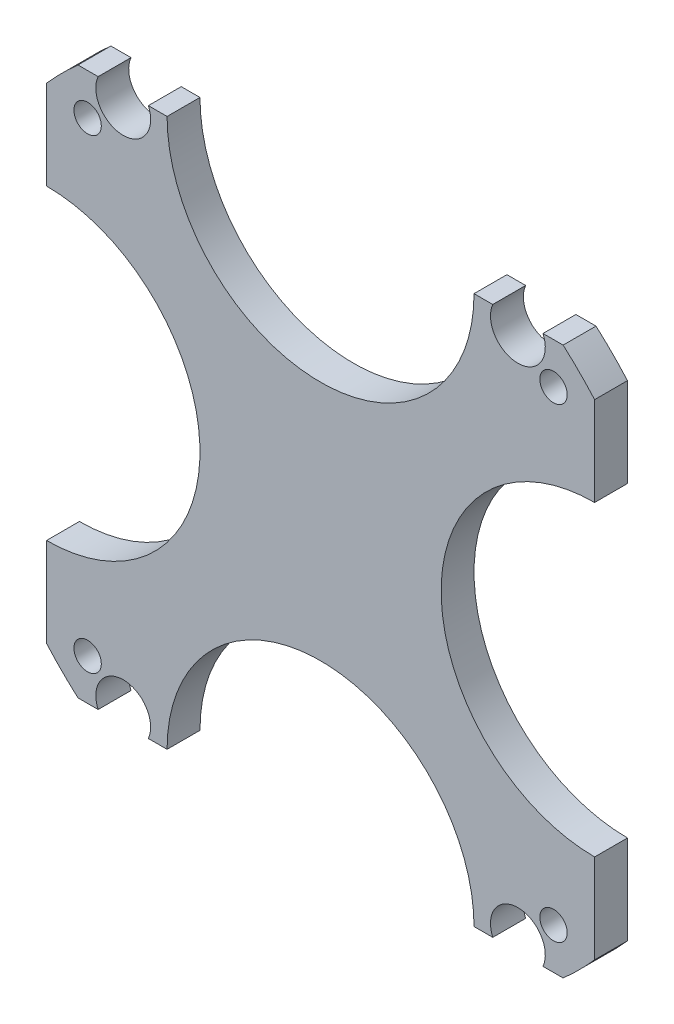
ISO-10303-21;
HEADER;
FILE_DESCRIPTION(('STEP AP214'),'2;1');
FILE_NAME('part.step','',(''),(''),'','','');
FILE_SCHEMA(('AUTOMOTIVE_DESIGN { 1 0 10303 214 1 1 1 1 }'));
ENDSEC;
DATA;
#1=APPLICATION_CONTEXT('core data for automotive mechanical design processes');
#2=APPLICATION_PROTOCOL_DEFINITION('international standard','automotive_design',2000,#1);
#3=PRODUCT_CONTEXT('',#1,'mechanical');
#4=PRODUCT('Part','Part','',(#3));
#5=PRODUCT_RELATED_PRODUCT_CATEGORY('part','',(#4));
#6=PRODUCT_DEFINITION_FORMATION('','',#4);
#7=PRODUCT_DEFINITION_CONTEXT('part definition',#1,'design');
#8=PRODUCT_DEFINITION('design','',#6,#7);
#9=PRODUCT_DEFINITION_SHAPE('','',#8);
#10=(LENGTH_UNIT() NAMED_UNIT(*) SI_UNIT(.MILLI.,.METRE.));
#11=(NAMED_UNIT(*) PLANE_ANGLE_UNIT() SI_UNIT($,.RADIAN.));
#12=(NAMED_UNIT(*) SI_UNIT($,.STERADIAN.) SOLID_ANGLE_UNIT());
#13=UNCERTAINTY_MEASURE_WITH_UNIT(LENGTH_MEASURE(1.E-05),#10,'distance_accuracy_value','');
#14=(GEOMETRIC_REPRESENTATION_CONTEXT(3) GLOBAL_UNCERTAINTY_ASSIGNED_CONTEXT((#13)) GLOBAL_UNIT_ASSIGNED_CONTEXT((#10,
#11,#12)) REPRESENTATION_CONTEXT('',''));
#15=CARTESIAN_POINT('',(0.,0.,0.));
#16=DIRECTION('',(0.,0.,1.));
#17=DIRECTION('',(1.,0.,0.));
#18=AXIS2_PLACEMENT_3D('',#15,#16,#17);
#19=CARTESIAN_POINT('',(0.,-25.,3.));
#20=DIRECTION('',(0.,1.,0.));
#21=DIRECTION('',(0.,0.,1.));
#22=AXIS2_PLACEMENT_3D('',#19,#20,#21);
#23=PLANE('',#22);
#24=DIRECTION('',(0.,0.,1.));
#25=VECTOR('',#24,1.);
#26=CARTESIAN_POINT('',(-20.2912878474779,-25.,-9.));
#27=LINE('',#26,#25);
#28=CARTESIAN_POINT('',(-20.2912878474779,-25.,3.));
#29=VERTEX_POINT('',#28);
#30=CARTESIAN_POINT('',(-20.2912878474779,-25.,0.));
#31=VERTEX_POINT('',#30);
#32=EDGE_CURVE('E266',#29,#31,#27,.F.);
#33=ORIENTED_EDGE('',*,*,#32,.F.);
#34=DIRECTION('',(1.,0.,0.));
#35=VECTOR('',#34,1.);
#36=CARTESIAN_POINT('',(0.,-25.,3.));
#37=LINE('',#36,#35);
#38=CARTESIAN_POINT('',(-22.1274659778656,-25.,3.));
#39=VERTEX_POINT('',#38);
#40=EDGE_CURVE('E231',#39,#29,#37,.T.);
#41=ORIENTED_EDGE('',*,*,#40,.F.);
#42=DIRECTION('',(0.,0.,-1.));
#43=VECTOR('',#42,1.);
#44=CARTESIAN_POINT('',(-22.1274659778656,-25.,3.));
#45=LINE('',#44,#43);
#46=CARTESIAN_POINT('',(-22.1274659778656,-25.,0.));
#47=VERTEX_POINT('',#46);
#48=EDGE_CURVE('E307',#39,#47,#45,.T.);
#49=ORIENTED_EDGE('',*,*,#48,.T.);
#50=DIRECTION('',(1.,0.,0.));
#51=VECTOR('',#50,1.);
#52=CARTESIAN_POINT('',(0.,-25.,0.));
#53=LINE('',#52,#51);
#54=EDGE_CURVE('E331',#47,#31,#53,.T.);
#55=ORIENTED_EDGE('',*,*,#54,.T.);
#56=EDGE_LOOP('',(#33,#41,#49,#55));
#57=FACE_BOUND('',#56,.T.);
#58=ADVANCED_FACE('F45',(#57),#23,.F.);
#59=DIRECTION('',(0.,0.,1.));
#60=VECTOR('',#59,1.);
#61=CARTESIAN_POINT('',(-15.7087121525221,-25.,-9.));
#62=LINE('',#61,#60);
#63=CARTESIAN_POINT('',(-15.7087121525221,-25.,0.));
#64=VERTEX_POINT('',#63);
#65=CARTESIAN_POINT('',(-15.7087121525221,-25.,3.));
#66=VERTEX_POINT('',#65);
#67=EDGE_CURVE('E268',#64,#66,#62,.T.);
#68=ORIENTED_EDGE('',*,*,#67,.F.);
#69=CARTESIAN_POINT('',(-14.,-25.,0.));
#70=VERTEX_POINT('',#69);
#71=EDGE_CURVE('E330',#64,#70,#53,.T.);
#72=ORIENTED_EDGE('',*,*,#71,.T.);
#73=DIRECTION('',(0.,0.,-1.));
#74=VECTOR('',#73,1.);
#75=CARTESIAN_POINT('',(-14.,-25.,3.));
#76=LINE('',#75,#74);
#77=CARTESIAN_POINT('',(-14.,-25.,3.));
#78=VERTEX_POINT('',#77);
#79=EDGE_CURVE('E395',#78,#70,#76,.T.);
#80=ORIENTED_EDGE('',*,*,#79,.F.);
#81=EDGE_CURVE('E232',#66,#78,#37,.T.);
#82=ORIENTED_EDGE('',*,*,#81,.F.);
#83=EDGE_LOOP('',(#68,#72,#80,#82));
#84=FACE_BOUND('',#83,.T.);
#85=ADVANCED_FACE('F455',(#84),#23,.F.);
#86=CARTESIAN_POINT('',(14.,-25.,0.));
#87=VERTEX_POINT('',#86);
#88=CARTESIAN_POINT('',(15.7087121525221,-25.,0.));
#89=VERTEX_POINT('',#88);
#90=EDGE_CURVE('E220',#87,#89,#53,.T.);
#91=ORIENTED_EDGE('',*,*,#90,.T.);
#92=DIRECTION('',(0.,0.,1.));
#93=VECTOR('',#92,1.);
#94=CARTESIAN_POINT('',(15.7087121525221,-25.,-9.));
#95=LINE('',#94,#93);
#96=CARTESIAN_POINT('',(15.7087121525221,-25.,3.));
#97=VERTEX_POINT('',#96);
#98=EDGE_CURVE('E60',#89,#97,#95,.T.);
#99=ORIENTED_EDGE('',*,*,#98,.T.);
#100=CARTESIAN_POINT('',(14.,-25.,3.));
#101=VERTEX_POINT('',#100);
#102=EDGE_CURVE('E218',#101,#97,#37,.T.);
#103=ORIENTED_EDGE('',*,*,#102,.F.);
#104=DIRECTION('',(0.,0.,-1.));
#105=VECTOR('',#104,1.);
#106=CARTESIAN_POINT('',(14.,-25.,3.));
#107=LINE('',#106,#105);
#108=EDGE_CURVE('E393',#101,#87,#107,.T.);
#109=ORIENTED_EDGE('',*,*,#108,.T.);
#110=EDGE_LOOP('',(#91,#99,#103,#109));
#111=FACE_BOUND('',#110,.T.);
#112=ADVANCED_FACE('F216',(#111),#23,.F.);
#113=CARTESIAN_POINT('',(0.,25.,3.));
#114=DIRECTION('',(0.,1.,0.));
#115=DIRECTION('',(0.,0.,1.));
#116=AXIS2_PLACEMENT_3D('',#113,#114,#115);
#117=PLANE('',#116);
#118=DIRECTION('',(1.,0.,0.));
#119=VECTOR('',#118,1.);
#120=CARTESIAN_POINT('',(0.,25.,3.));
#121=LINE('',#120,#119);
#122=CARTESIAN_POINT('',(14.,25.,3.));
#123=VERTEX_POINT('',#122);
#124=CARTESIAN_POINT('',(15.7087121525221,25.,3.));
#125=VERTEX_POINT('',#124);
#126=EDGE_CURVE('E279',#123,#125,#121,.T.);
#127=ORIENTED_EDGE('',*,*,#126,.T.);
#128=DIRECTION('',(0.,0.,1.));
#129=VECTOR('',#128,1.);
#130=CARTESIAN_POINT('',(15.7087121525221,25.,-9.));
#131=LINE('',#130,#129);
#132=CARTESIAN_POINT('',(15.7087121525221,25.,0.));
#133=VERTEX_POINT('',#132);
#134=EDGE_CURVE('E262',#125,#133,#131,.F.);
#135=ORIENTED_EDGE('',*,*,#134,.T.);
#136=DIRECTION('',(1.,0.,0.));
#137=VECTOR('',#136,1.);
#138=CARTESIAN_POINT('',(0.,25.,0.));
#139=LINE('',#138,#137);
#140=CARTESIAN_POINT('',(14.,25.,0.));
#141=VERTEX_POINT('',#140);
#142=EDGE_CURVE('E348',#141,#133,#139,.T.);
#143=ORIENTED_EDGE('',*,*,#142,.F.);
#144=DIRECTION('',(0.,0.,-1.));
#145=VECTOR('',#144,1.);
#146=CARTESIAN_POINT('',(14.,25.,3.));
#147=LINE('',#146,#145);
#148=EDGE_CURVE('E286',#123,#141,#147,.T.);
#149=ORIENTED_EDGE('',*,*,#148,.F.);
#150=EDGE_LOOP('',(#127,#135,#143,#149));
#151=FACE_BOUND('',#150,.T.);
#152=ADVANCED_FACE('F283',(#151),#117,.T.);
#153=CARTESIAN_POINT('',(20.2912878474779,25.,0.));
#154=VERTEX_POINT('',#153);
#155=CARTESIAN_POINT('',(22.1274659778656,25.,0.));
#156=VERTEX_POINT('',#155);
#157=EDGE_CURVE('E351',#154,#156,#139,.T.);
#158=ORIENTED_EDGE('',*,*,#157,.F.);
#159=DIRECTION('',(0.,0.,1.));
#160=VECTOR('',#159,1.);
#161=CARTESIAN_POINT('',(20.2912878474779,25.,-9.));
#162=LINE('',#161,#160);
#163=CARTESIAN_POINT('',(20.2912878474779,25.,3.));
#164=VERTEX_POINT('',#163);
#165=EDGE_CURVE('E68',#154,#164,#162,.T.);
#166=ORIENTED_EDGE('',*,*,#165,.T.);
#167=CARTESIAN_POINT('',(22.1274659778656,25.,3.));
#168=VERTEX_POINT('',#167);
#169=EDGE_CURVE('E281',#164,#168,#121,.T.);
#170=ORIENTED_EDGE('',*,*,#169,.T.);
#171=DIRECTION('',(0.,0.,-1.));
#172=VECTOR('',#171,1.);
#173=CARTESIAN_POINT('',(22.1274659778656,25.,3.));
#174=LINE('',#173,#172);
#175=EDGE_CURVE('E379',#168,#156,#174,.T.);
#176=ORIENTED_EDGE('',*,*,#175,.T.);
#177=EDGE_LOOP('',(#158,#166,#170,#176));
#178=FACE_BOUND('',#177,.T.);
#179=ADVANCED_FACE('F562',(#178),#117,.T.);
#180=DIRECTION('',(0.,0.,1.));
#181=VECTOR('',#180,1.);
#182=CARTESIAN_POINT('',(-20.2912878474779,25.,-9.));
#183=LINE('',#182,#181);
#184=CARTESIAN_POINT('',(-20.2912878474779,25.,0.));
#185=VERTEX_POINT('',#184);
#186=CARTESIAN_POINT('',(-20.2912878474779,25.,3.));
#187=VERTEX_POINT('',#186);
#188=EDGE_CURVE('E257',#185,#187,#183,.T.);
#189=ORIENTED_EDGE('',*,*,#188,.F.);
#190=CARTESIAN_POINT('',(-22.1274659778656,25.,0.));
#191=VERTEX_POINT('',#190);
#192=EDGE_CURVE('E352',#191,#185,#139,.T.);
#193=ORIENTED_EDGE('',*,*,#192,.F.);
#194=DIRECTION('',(0.,0.,-1.));
#195=VECTOR('',#194,1.);
#196=CARTESIAN_POINT('',(-22.1274659778656,25.,3.));
#197=LINE('',#196,#195);
#198=CARTESIAN_POINT('',(-22.1274659778656,25.,3.));
#199=VERTEX_POINT('',#198);
#200=EDGE_CURVE('E373',#199,#191,#197,.T.);
#201=ORIENTED_EDGE('',*,*,#200,.F.);
#202=EDGE_CURVE('E291',#199,#187,#121,.T.);
#203=ORIENTED_EDGE('',*,*,#202,.T.);
#204=EDGE_LOOP('',(#189,#193,#201,#203));
#205=FACE_BOUND('',#204,.T.);
#206=ADVANCED_FACE('F487',(#205),#117,.T.);
#207=CARTESIAN_POINT('',(0.,0.,3.));
#208=DIRECTION('',(0.,0.,1.));
#209=DIRECTION('',(1.,0.,0.));
#210=AXIS2_PLACEMENT_3D('',#207,#208,#209);
#211=PLANE('',#210);
#212=CARTESIAN_POINT('',(-21.25,-21.25,3.));
#213=DIRECTION('',(0.,0.,1.));
#214=DIRECTION('',(1.,0.,0.));
#215=AXIS2_PLACEMENT_3D('',#212,#213,#214);
#216=CIRCLE('',#215,1.25);
#217=CARTESIAN_POINT('',(-20.,-21.25,3.));
#218=VERTEX_POINT('',#217);
#219=EDGE_CURVE('E253',#218,#218,#216,.F.);
#220=ORIENTED_EDGE('',*,*,#219,.T.);
#221=EDGE_LOOP('',(#220));
#222=FACE_BOUND('',#221,.T.);
#223=CARTESIAN_POINT('',(-21.25,21.25,3.));
#224=DIRECTION('',(0.,0.,1.));
#225=DIRECTION('',(1.,0.,0.));
#226=AXIS2_PLACEMENT_3D('',#223,#224,#225);
#227=CIRCLE('',#226,1.25);
#228=CARTESIAN_POINT('',(-20.,21.25,3.));
#229=VERTEX_POINT('',#228);
#230=EDGE_CURVE('E248',#229,#229,#227,.T.);
#231=ORIENTED_EDGE('',*,*,#230,.F.);
#232=EDGE_LOOP('',(#231));
#233=FACE_BOUND('',#232,.T.);
#234=CARTESIAN_POINT('',(21.25,-21.25,3.));
#235=DIRECTION('',(0.,0.,1.));
#236=DIRECTION('',(1.,0.,0.));
#237=AXIS2_PLACEMENT_3D('',#234,#235,#236);
#238=CIRCLE('',#237,1.25);
#239=CARTESIAN_POINT('',(22.5,-21.25,3.));
#240=VERTEX_POINT('',#239);
#241=EDGE_CURVE('E244',#240,#240,#238,.T.);
#242=ORIENTED_EDGE('',*,*,#241,.F.);
#243=EDGE_LOOP('',(#242));
#244=FACE_BOUND('',#243,.T.);
#245=CARTESIAN_POINT('',(21.25,21.25,3.));
#246=DIRECTION('',(0.,0.,1.));
#247=DIRECTION('',(1.,0.,0.));
#248=AXIS2_PLACEMENT_3D('',#245,#246,#247);
#249=CIRCLE('',#248,1.25);
#250=CARTESIAN_POINT('',(22.5,21.25,3.));
#251=VERTEX_POINT('',#250);
#252=EDGE_CURVE('E240',#251,#251,#249,.F.);
#253=ORIENTED_EDGE('',*,*,#252,.T.);
#254=EDGE_LOOP('',(#253));
#255=FACE_BOUND('',#254,.T.);
#256=CARTESIAN_POINT('',(-18.,24.,3.));
#257=DIRECTION('',(0.,0.,1.));
#258=DIRECTION('',(1.,0.,0.));
#259=AXIS2_PLACEMENT_3D('',#256,#257,#258);
#260=CIRCLE('',#259,2.5);
#261=CARTESIAN_POINT('',(-15.7087121525221,25.,3.));
#262=VERTEX_POINT('',#261);
#263=EDGE_CURVE('E211',#187,#262,#260,.T.);
#264=ORIENTED_EDGE('',*,*,#263,.F.);
#265=ORIENTED_EDGE('',*,*,#202,.F.);
#266=CARTESIAN_POINT('',(0.,0.,3.));
#267=DIRECTION('',(0.,0.,1.));
#268=DIRECTION('',(1.,0.,0.));
#269=AXIS2_PLACEMENT_3D('',#266,#267,#268);
#270=CIRCLE('',#269,33.3859963248306);
#271=CARTESIAN_POINT('',(-25.,22.1274659778656,3.));
#272=VERTEX_POINT('',#271);
#273=EDGE_CURVE('E295',#199,#272,#270,.T.);
#274=ORIENTED_EDGE('',*,*,#273,.T.);
#275=DIRECTION('',(0.,-1.,0.));
#276=VECTOR('',#275,1.);
#277=CARTESIAN_POINT('',(-25.,0.,3.));
#278=LINE('',#277,#276);
#279=CARTESIAN_POINT('',(-25.,14.,3.));
#280=VERTEX_POINT('',#279);
#281=EDGE_CURVE('E299',#272,#280,#278,.T.);
#282=ORIENTED_EDGE('',*,*,#281,.T.);
#283=CARTESIAN_POINT('',(-25.,0.,3.));
#284=DIRECTION('',(0.,0.,1.));
#285=DIRECTION('',(1.,0.,0.));
#286=AXIS2_PLACEMENT_3D('',#283,#284,#285);
#287=CIRCLE('',#286,14.);
#288=CARTESIAN_POINT('',(-25.,-14.,3.));
#289=VERTEX_POINT('',#288);
#290=EDGE_CURVE('E302',#289,#280,#287,.T.);
#291=ORIENTED_EDGE('',*,*,#290,.F.);
#292=CARTESIAN_POINT('',(-25.,-22.1274659778656,3.));
#293=VERTEX_POINT('',#292);
#294=EDGE_CURVE('E304',#289,#293,#278,.T.);
#295=ORIENTED_EDGE('',*,*,#294,.T.);
#296=EDGE_CURVE('E235',#293,#39,#270,.T.);
#297=ORIENTED_EDGE('',*,*,#296,.T.);
#298=ORIENTED_EDGE('',*,*,#40,.T.);
#299=CARTESIAN_POINT('',(-18.,-24.,3.));
#300=DIRECTION('',(0.,0.,-1.));
#301=DIRECTION('',(-1.,0.,0.));
#302=AXIS2_PLACEMENT_3D('',#299,#300,#301);
#303=CIRCLE('',#302,2.5);
#304=EDGE_CURVE('E270',#29,#66,#303,.T.);
#305=ORIENTED_EDGE('',*,*,#304,.T.);
#306=ORIENTED_EDGE('',*,*,#81,.T.);
#307=CARTESIAN_POINT('',(0.,-25.,3.));
#308=DIRECTION('',(0.,0.,1.));
#309=DIRECTION('',(1.,0.,0.));
#310=AXIS2_PLACEMENT_3D('',#307,#308,#309);
#311=CIRCLE('',#310,14.);
#312=EDGE_CURVE('E226',#78,#101,#311,.F.);
#313=ORIENTED_EDGE('',*,*,#312,.T.);
#314=ORIENTED_EDGE('',*,*,#102,.T.);
#315=CARTESIAN_POINT('',(18.,-24.,3.));
#316=DIRECTION('',(0.,0.,1.));
#317=DIRECTION('',(1.,0.,0.));
#318=AXIS2_PLACEMENT_3D('',#315,#316,#317);
#319=CIRCLE('',#318,2.5);
#320=CARTESIAN_POINT('',(20.2912878474779,-25.,3.));
#321=VERTEX_POINT('',#320);
#322=EDGE_CURVE('E204',#321,#97,#319,.T.);
#323=ORIENTED_EDGE('',*,*,#322,.F.);
#324=CARTESIAN_POINT('',(22.1274659778656,-25.,3.));
#325=VERTEX_POINT('',#324);
#326=EDGE_CURVE('E229',#321,#325,#37,.T.);
#327=ORIENTED_EDGE('',*,*,#326,.T.);
#328=CARTESIAN_POINT('',(25.,-22.1274659778656,3.));
#329=VERTEX_POINT('',#328);
#330=EDGE_CURVE('E228',#325,#329,#270,.T.);
#331=ORIENTED_EDGE('',*,*,#330,.T.);
#332=DIRECTION('',(0.,-1.,0.));
#333=VECTOR('',#332,1.);
#334=CARTESIAN_POINT('',(25.,0.,3.));
#335=LINE('',#334,#333);
#336=CARTESIAN_POINT('',(25.,-14.,3.));
#337=VERTEX_POINT('',#336);
#338=EDGE_CURVE('E233',#337,#329,#335,.T.);
#339=ORIENTED_EDGE('',*,*,#338,.F.);
#340=CARTESIAN_POINT('',(25.,0.,3.));
#341=DIRECTION('',(0.,0.,1.));
#342=DIRECTION('',(1.,0.,0.));
#343=AXIS2_PLACEMENT_3D('',#340,#341,#342);
#344=CIRCLE('',#343,14.);
#345=CARTESIAN_POINT('',(25.,14.,3.));
#346=VERTEX_POINT('',#345);
#347=EDGE_CURVE('E421',#346,#337,#344,.T.);
#348=ORIENTED_EDGE('',*,*,#347,.F.);
#349=CARTESIAN_POINT('',(25.,22.1274659778656,3.));
#350=VERTEX_POINT('',#349);
#351=EDGE_CURVE('E306',#350,#346,#335,.T.);
#352=ORIENTED_EDGE('',*,*,#351,.F.);
#353=EDGE_CURVE('E236',#350,#168,#270,.T.);
#354=ORIENTED_EDGE('',*,*,#353,.T.);
#355=ORIENTED_EDGE('',*,*,#169,.F.);
#356=CARTESIAN_POINT('',(18.,24.,3.));
#357=DIRECTION('',(0.,0.,-1.));
#358=DIRECTION('',(-1.,0.,0.));
#359=AXIS2_PLACEMENT_3D('',#356,#357,#358);
#360=CIRCLE('',#359,2.5);
#361=EDGE_CURVE('E221',#164,#125,#360,.T.);
#362=ORIENTED_EDGE('',*,*,#361,.T.);
#363=ORIENTED_EDGE('',*,*,#126,.F.);
#364=CARTESIAN_POINT('',(0.,25.,3.));
#365=DIRECTION('',(0.,0.,1.));
#366=DIRECTION('',(1.,0.,0.));
#367=AXIS2_PLACEMENT_3D('',#364,#365,#366);
#368=CIRCLE('',#367,14.);
#369=CARTESIAN_POINT('',(-14.,25.,3.));
#370=VERTEX_POINT('',#369);
#371=EDGE_CURVE('E288',#123,#370,#368,.F.);
#372=ORIENTED_EDGE('',*,*,#371,.T.);
#373=EDGE_CURVE('E290',#262,#370,#121,.T.);
#374=ORIENTED_EDGE('',*,*,#373,.F.);
#375=EDGE_LOOP('',(#264,#265,#274,#282,#291,#295,#297,#298,#305,#306,#313,#314,#323,#327,#331,
#339,#348,#352,#354,#355,#362,#363,#372,#374));
#376=FACE_BOUND('',#375,.T.);
#377=ADVANCED_FACE('F224',(#222,#233,#244,#255,#376),#211,.T.);
#378=CARTESIAN_POINT('',(0.,0.,0.));
#379=DIRECTION('',(0.,0.,1.));
#380=DIRECTION('',(1.,0.,0.));
#381=AXIS2_PLACEMENT_3D('',#378,#379,#380);
#382=PLANE('',#381);
#383=CARTESIAN_POINT('',(-21.25,-21.25,0.));
#384=DIRECTION('',(0.,0.,1.));
#385=DIRECTION('',(1.,0.,0.));
#386=AXIS2_PLACEMENT_3D('',#383,#384,#385);
#387=CIRCLE('',#386,1.25);
#388=CARTESIAN_POINT('',(-20.,-21.25,0.));
#389=VERTEX_POINT('',#388);
#390=EDGE_CURVE('E259',#389,#389,#387,.F.);
#391=ORIENTED_EDGE('',*,*,#390,.F.);
#392=EDGE_LOOP('',(#391));
#393=FACE_BOUND('',#392,.T.);
#394=CARTESIAN_POINT('',(-21.25,21.25,0.));
#395=DIRECTION('',(0.,0.,1.));
#396=DIRECTION('',(1.,0.,0.));
#397=AXIS2_PLACEMENT_3D('',#394,#395,#396);
#398=CIRCLE('',#397,1.25);
#399=CARTESIAN_POINT('',(-20.,21.25,0.));
#400=VERTEX_POINT('',#399);
#401=EDGE_CURVE('E321',#400,#400,#398,.T.);
#402=ORIENTED_EDGE('',*,*,#401,.T.);
#403=EDGE_LOOP('',(#402));
#404=FACE_BOUND('',#403,.T.);
#405=CARTESIAN_POINT('',(21.25,-21.25,0.));
#406=DIRECTION('',(0.,0.,1.));
#407=DIRECTION('',(1.,0.,0.));
#408=AXIS2_PLACEMENT_3D('',#405,#406,#407);
#409=CIRCLE('',#408,1.25);
#410=CARTESIAN_POINT('',(22.5,-21.25,0.));
#411=VERTEX_POINT('',#410);
#412=EDGE_CURVE('E324',#411,#411,#409,.T.);
#413=ORIENTED_EDGE('',*,*,#412,.T.);
#414=EDGE_LOOP('',(#413));
#415=FACE_BOUND('',#414,.T.);
#416=CARTESIAN_POINT('',(21.25,21.25,0.));
#417=DIRECTION('',(0.,0.,1.));
#418=DIRECTION('',(1.,0.,0.));
#419=AXIS2_PLACEMENT_3D('',#416,#417,#418);
#420=CIRCLE('',#419,1.25);
#421=CARTESIAN_POINT('',(22.5,21.25,0.));
#422=VERTEX_POINT('',#421);
#423=EDGE_CURVE('E327',#422,#422,#420,.F.);
#424=ORIENTED_EDGE('',*,*,#423,.F.);
#425=EDGE_LOOP('',(#424));
#426=FACE_BOUND('',#425,.T.);
#427=ORIENTED_EDGE('',*,*,#192,.T.);
#428=CARTESIAN_POINT('',(-18.,24.,0.));
#429=DIRECTION('',(0.,0.,1.));
#430=DIRECTION('',(1.,0.,0.));
#431=AXIS2_PLACEMENT_3D('',#428,#429,#430);
#432=CIRCLE('',#431,2.5);
#433=CARTESIAN_POINT('',(-15.7087121525221,25.,0.));
#434=VERTEX_POINT('',#433);
#435=EDGE_CURVE('E12',#185,#434,#432,.T.);
#436=ORIENTED_EDGE('',*,*,#435,.T.);
#437=CARTESIAN_POINT('',(-14.,25.,0.));
#438=VERTEX_POINT('',#437);
#439=EDGE_CURVE('E355',#434,#438,#139,.T.);
#440=ORIENTED_EDGE('',*,*,#439,.T.);
#441=CARTESIAN_POINT('',(0.,25.,0.));
#442=DIRECTION('',(0.,0.,1.));
#443=DIRECTION('',(1.,0.,0.));
#444=AXIS2_PLACEMENT_3D('',#441,#442,#443);
#445=CIRCLE('',#444,14.);
#446=EDGE_CURVE('E350',#141,#438,#445,.F.);
#447=ORIENTED_EDGE('',*,*,#446,.F.);
#448=ORIENTED_EDGE('',*,*,#142,.T.);
#449=CARTESIAN_POINT('',(18.,24.,0.));
#450=DIRECTION('',(0.,0.,1.));
#451=DIRECTION('',(1.,0.,0.));
#452=AXIS2_PLACEMENT_3D('',#449,#450,#451);
#453=CIRCLE('',#452,2.5);
#454=EDGE_CURVE('E400',#154,#133,#453,.F.);
#455=ORIENTED_EDGE('',*,*,#454,.F.);
#456=ORIENTED_EDGE('',*,*,#157,.T.);
#457=CARTESIAN_POINT('',(0.,0.,0.));
#458=DIRECTION('',(0.,0.,1.));
#459=DIRECTION('',(1.,0.,0.));
#460=AXIS2_PLACEMENT_3D('',#457,#458,#459);
#461=CIRCLE('',#460,33.3859963248306);
#462=CARTESIAN_POINT('',(25.,22.1274659778656,0.));
#463=VERTEX_POINT('',#462);
#464=EDGE_CURVE('E341',#463,#156,#461,.T.);
#465=ORIENTED_EDGE('',*,*,#464,.F.);
#466=DIRECTION('',(0.,-1.,0.));
#467=VECTOR('',#466,1.);
#468=CARTESIAN_POINT('',(25.,0.,0.));
#469=LINE('',#468,#467);
#470=CARTESIAN_POINT('',(25.,14.,0.));
#471=VERTEX_POINT('',#470);
#472=EDGE_CURVE('E345',#463,#471,#469,.T.);
#473=ORIENTED_EDGE('',*,*,#472,.T.);
#474=CARTESIAN_POINT('',(25.,0.,0.));
#475=DIRECTION('',(0.,0.,1.));
#476=DIRECTION('',(1.,0.,0.));
#477=AXIS2_PLACEMENT_3D('',#474,#475,#476);
#478=CIRCLE('',#477,14.);
#479=CARTESIAN_POINT('',(25.,-14.,0.));
#480=VERTEX_POINT('',#479);
#481=EDGE_CURVE('E344',#471,#480,#478,.T.);
#482=ORIENTED_EDGE('',*,*,#481,.T.);
#483=CARTESIAN_POINT('',(25.,-22.1274659778656,0.));
#484=VERTEX_POINT('',#483);
#485=EDGE_CURVE('E340',#480,#484,#469,.T.);
#486=ORIENTED_EDGE('',*,*,#485,.T.);
#487=CARTESIAN_POINT('',(22.1274659778656,-25.,0.));
#488=VERTEX_POINT('',#487);
#489=EDGE_CURVE('E337',#488,#484,#461,.T.);
#490=ORIENTED_EDGE('',*,*,#489,.F.);
#491=CARTESIAN_POINT('',(20.2912878474779,-25.,0.));
#492=VERTEX_POINT('',#491);
#493=EDGE_CURVE('E335',#492,#488,#53,.T.);
#494=ORIENTED_EDGE('',*,*,#493,.F.);
#495=CARTESIAN_POINT('',(18.,-24.,0.));
#496=DIRECTION('',(0.,0.,1.));
#497=DIRECTION('',(1.,0.,0.));
#498=AXIS2_PLACEMENT_3D('',#495,#496,#497);
#499=CIRCLE('',#498,2.5);
#500=EDGE_CURVE('E53',#492,#89,#499,.T.);
#501=ORIENTED_EDGE('',*,*,#500,.T.);
#502=ORIENTED_EDGE('',*,*,#90,.F.);
#503=CARTESIAN_POINT('',(0.,-25.,0.));
#504=DIRECTION('',(0.,0.,1.));
#505=DIRECTION('',(1.,0.,0.));
#506=AXIS2_PLACEMENT_3D('',#503,#504,#505);
#507=CIRCLE('',#506,14.);
#508=EDGE_CURVE('E334',#70,#87,#507,.F.);
#509=ORIENTED_EDGE('',*,*,#508,.F.);
#510=ORIENTED_EDGE('',*,*,#71,.F.);
#511=CARTESIAN_POINT('',(-18.,-24.,0.));
#512=DIRECTION('',(0.,0.,1.));
#513=DIRECTION('',(1.,0.,0.));
#514=AXIS2_PLACEMENT_3D('',#511,#512,#513);
#515=CIRCLE('',#514,2.5);
#516=EDGE_CURVE('E398',#31,#64,#515,.F.);
#517=ORIENTED_EDGE('',*,*,#516,.F.);
#518=ORIENTED_EDGE('',*,*,#54,.F.);
#519=CARTESIAN_POINT('',(-25.,-22.1274659778656,0.));
#520=VERTEX_POINT('',#519);
#521=EDGE_CURVE('E256',#520,#47,#461,.T.);
#522=ORIENTED_EDGE('',*,*,#521,.F.);
#523=DIRECTION('',(0.,-1.,0.));
#524=VECTOR('',#523,1.);
#525=CARTESIAN_POINT('',(-25.,0.,0.));
#526=LINE('',#525,#524);
#527=CARTESIAN_POINT('',(-25.,-14.,0.));
#528=VERTEX_POINT('',#527);
#529=EDGE_CURVE('E361',#528,#520,#526,.T.);
#530=ORIENTED_EDGE('',*,*,#529,.F.);
#531=CARTESIAN_POINT('',(-25.,0.,0.));
#532=DIRECTION('',(0.,0.,1.));
#533=DIRECTION('',(1.,0.,0.));
#534=AXIS2_PLACEMENT_3D('',#531,#532,#533);
#535=CIRCLE('',#534,14.);
#536=CARTESIAN_POINT('',(-25.,14.,0.));
#537=VERTEX_POINT('',#536);
#538=EDGE_CURVE('E359',#528,#537,#535,.T.);
#539=ORIENTED_EDGE('',*,*,#538,.T.);
#540=CARTESIAN_POINT('',(-25.,22.1274659778656,0.));
#541=VERTEX_POINT('',#540);
#542=EDGE_CURVE('E356',#541,#537,#526,.T.);
#543=ORIENTED_EDGE('',*,*,#542,.F.);
#544=EDGE_CURVE('E360',#191,#541,#461,.T.);
#545=ORIENTED_EDGE('',*,*,#544,.F.);
#546=EDGE_LOOP('',(#427,#436,#440,#447,#448,#455,#456,#465,#473,#482,#486,#490,#494,#501,#502,
#509,#510,#517,#518,#522,#530,#539,#543,#545));
#547=FACE_BOUND('',#546,.T.);
#548=ADVANCED_FACE('F404',(#393,#404,#415,#426,#547),#382,.F.);
#549=CARTESIAN_POINT('',(0.,-25.,3.));
#550=DIRECTION('',(0.,0.,-1.));
#551=DIRECTION('',(-1.,0.,0.));
#552=AXIS2_PLACEMENT_3D('',#549,#550,#551);
#553=CYLINDRICAL_SURFACE('',#552,14.);
#554=ORIENTED_EDGE('',*,*,#508,.T.);
#555=ORIENTED_EDGE('',*,*,#108,.F.);
#556=ORIENTED_EDGE('',*,*,#312,.F.);
#557=ORIENTED_EDGE('',*,*,#79,.T.);
#558=EDGE_LOOP('',(#554,#555,#556,#557));
#559=FACE_BOUND('',#558,.T.);
#560=ADVANCED_FACE('F457',(#559),#553,.F.);
#561=ORIENTED_EDGE('',*,*,#326,.F.);
#562=DIRECTION('',(0.,0.,1.));
#563=VECTOR('',#562,1.);
#564=CARTESIAN_POINT('',(20.2912878474779,-25.,-9.));
#565=LINE('',#564,#563);
#566=EDGE_CURVE('E207',#492,#321,#565,.T.);
#567=ORIENTED_EDGE('',*,*,#566,.F.);
#568=ORIENTED_EDGE('',*,*,#493,.T.);
#569=DIRECTION('',(0.,0.,-1.));
#570=VECTOR('',#569,1.);
#571=CARTESIAN_POINT('',(22.1274659778656,-25.,3.));
#572=LINE('',#571,#570);
#573=EDGE_CURVE('E390',#325,#488,#572,.T.);
#574=ORIENTED_EDGE('',*,*,#573,.F.);
#575=EDGE_LOOP('',(#561,#567,#568,#574));
#576=FACE_BOUND('',#575,.T.);
#577=ADVANCED_FACE('F408',(#576),#23,.F.);
#578=CARTESIAN_POINT('',(0.,0.,3.));
#579=DIRECTION('',(0.,0.,-1.));
#580=DIRECTION('',(-1.,0.,0.));
#581=AXIS2_PLACEMENT_3D('',#578,#579,#580);
#582=CYLINDRICAL_SURFACE('',#581,33.3859963248306);
#583=ORIENTED_EDGE('',*,*,#489,.T.);
#584=DIRECTION('',(0.,0.,-1.));
#585=VECTOR('',#584,1.);
#586=CARTESIAN_POINT('',(25.,-22.1274659778656,3.));
#587=LINE('',#586,#585);
#588=EDGE_CURVE('E388',#329,#484,#587,.T.);
#589=ORIENTED_EDGE('',*,*,#588,.F.);
#590=ORIENTED_EDGE('',*,*,#330,.F.);
#591=ORIENTED_EDGE('',*,*,#573,.T.);
#592=EDGE_LOOP('',(#583,#589,#590,#591));
#593=FACE_BOUND('',#592,.T.);
#594=ADVANCED_FACE('F417',(#593),#582,.T.);
#595=CARTESIAN_POINT('',(25.,0.,3.));
#596=DIRECTION('',(1.,0.,0.));
#597=DIRECTION('',(0.,1.,0.));
#598=AXIS2_PLACEMENT_3D('',#595,#596,#597);
#599=PLANE('',#598);
#600=ORIENTED_EDGE('',*,*,#485,.F.);
#601=DIRECTION('',(0.,0.,-1.));
#602=VECTOR('',#601,1.);
#603=CARTESIAN_POINT('',(25.,-14.,3.));
#604=LINE('',#603,#602);
#605=EDGE_CURVE('E386',#337,#480,#604,.T.);
#606=ORIENTED_EDGE('',*,*,#605,.F.);
#607=ORIENTED_EDGE('',*,*,#338,.T.);
#608=ORIENTED_EDGE('',*,*,#588,.T.);
#609=EDGE_LOOP('',(#600,#606,#607,#608));
#610=FACE_BOUND('',#609,.T.);
#611=ADVANCED_FACE('F420',(#610),#599,.T.);
#612=CARTESIAN_POINT('',(25.,0.,3.));
#613=DIRECTION('',(0.,0.,-1.));
#614=DIRECTION('',(-1.,0.,0.));
#615=AXIS2_PLACEMENT_3D('',#612,#613,#614);
#616=CYLINDRICAL_SURFACE('',#615,14.);
#617=ORIENTED_EDGE('',*,*,#481,.F.);
#618=DIRECTION('',(0.,0.,-1.));
#619=VECTOR('',#618,1.);
#620=CARTESIAN_POINT('',(25.,14.,3.));
#621=LINE('',#620,#619);
#622=EDGE_CURVE('E384',#346,#471,#621,.T.);
#623=ORIENTED_EDGE('',*,*,#622,.F.);
#624=ORIENTED_EDGE('',*,*,#347,.T.);
#625=ORIENTED_EDGE('',*,*,#605,.T.);
#626=EDGE_LOOP('',(#617,#623,#624,#625));
#627=FACE_BOUND('',#626,.T.);
#628=ADVANCED_FACE('F431',(#627),#616,.F.);
#629=ORIENTED_EDGE('',*,*,#472,.F.);
#630=DIRECTION('',(0.,0.,-1.));
#631=VECTOR('',#630,1.);
#632=CARTESIAN_POINT('',(25.,22.1274659778656,3.));
#633=LINE('',#632,#631);
#634=EDGE_CURVE('E382',#350,#463,#633,.T.);
#635=ORIENTED_EDGE('',*,*,#634,.F.);
#636=ORIENTED_EDGE('',*,*,#351,.T.);
#637=ORIENTED_EDGE('',*,*,#622,.T.);
#638=EDGE_LOOP('',(#629,#635,#636,#637));
#639=FACE_BOUND('',#638,.T.);
#640=ADVANCED_FACE('F426',(#639),#599,.T.);
#641=ORIENTED_EDGE('',*,*,#464,.T.);
#642=ORIENTED_EDGE('',*,*,#175,.F.);
#643=ORIENTED_EDGE('',*,*,#353,.F.);
#644=ORIENTED_EDGE('',*,*,#634,.T.);
#645=EDGE_LOOP('',(#641,#642,#643,#644));
#646=FACE_BOUND('',#645,.T.);
#647=ADVANCED_FACE('F477',(#646),#582,.T.);
#648=CARTESIAN_POINT('',(0.,25.,3.));
#649=DIRECTION('',(0.,0.,-1.));
#650=DIRECTION('',(-1.,0.,0.));
#651=AXIS2_PLACEMENT_3D('',#648,#649,#650);
#652=CYLINDRICAL_SURFACE('',#651,14.);
#653=ORIENTED_EDGE('',*,*,#446,.T.);
#654=DIRECTION('',(0.,0.,-1.));
#655=VECTOR('',#654,1.);
#656=CARTESIAN_POINT('',(-14.,25.,3.));
#657=LINE('',#656,#655);
#658=EDGE_CURVE('E375',#370,#438,#657,.T.);
#659=ORIENTED_EDGE('',*,*,#658,.F.);
#660=ORIENTED_EDGE('',*,*,#371,.F.);
#661=ORIENTED_EDGE('',*,*,#148,.T.);
#662=EDGE_LOOP('',(#653,#659,#660,#661));
#663=FACE_BOUND('',#662,.T.);
#664=ADVANCED_FACE('F478',(#663),#652,.F.);
#665=DIRECTION('',(0.,0.,1.));
#666=VECTOR('',#665,1.);
#667=CARTESIAN_POINT('',(-15.7087121525221,25.,-9.));
#668=LINE('',#667,#666);
#669=EDGE_CURVE('E260',#262,#434,#668,.F.);
#670=ORIENTED_EDGE('',*,*,#669,.F.);
#671=ORIENTED_EDGE('',*,*,#373,.T.);
#672=ORIENTED_EDGE('',*,*,#658,.T.);
#673=ORIENTED_EDGE('',*,*,#439,.F.);
#674=EDGE_LOOP('',(#670,#671,#672,#673));
#675=FACE_BOUND('',#674,.T.);
#676=ADVANCED_FACE('F481',(#675),#117,.T.);
#677=ORIENTED_EDGE('',*,*,#544,.T.);
#678=DIRECTION('',(0.,0.,-1.));
#679=VECTOR('',#678,1.);
#680=CARTESIAN_POINT('',(-25.,22.1274659778656,3.));
#681=LINE('',#680,#679);
#682=EDGE_CURVE('E370',#272,#541,#681,.T.);
#683=ORIENTED_EDGE('',*,*,#682,.F.);
#684=ORIENTED_EDGE('',*,*,#273,.F.);
#685=ORIENTED_EDGE('',*,*,#200,.T.);
#686=EDGE_LOOP('',(#677,#683,#684,#685));
#687=FACE_BOUND('',#686,.T.);
#688=ADVANCED_FACE('F485',(#687),#582,.T.);
#689=CARTESIAN_POINT('',(-25.,0.,3.));
#690=DIRECTION('',(1.,0.,0.));
#691=DIRECTION('',(0.,1.,0.));
#692=AXIS2_PLACEMENT_3D('',#689,#690,#691);
#693=PLANE('',#692);
#694=ORIENTED_EDGE('',*,*,#542,.T.);
#695=DIRECTION('',(0.,0.,-1.));
#696=VECTOR('',#695,1.);
#697=CARTESIAN_POINT('',(-25.,14.,3.));
#698=LINE('',#697,#696);
#699=EDGE_CURVE('E368',#280,#537,#698,.T.);
#700=ORIENTED_EDGE('',*,*,#699,.F.);
#701=ORIENTED_EDGE('',*,*,#281,.F.);
#702=ORIENTED_EDGE('',*,*,#682,.T.);
#703=EDGE_LOOP('',(#694,#700,#701,#702));
#704=FACE_BOUND('',#703,.T.);
#705=ADVANCED_FACE('F491',(#704),#693,.F.);
#706=CARTESIAN_POINT('',(-25.,0.,3.));
#707=DIRECTION('',(0.,0.,-1.));
#708=DIRECTION('',(-1.,0.,0.));
#709=AXIS2_PLACEMENT_3D('',#706,#707,#708);
#710=CYLINDRICAL_SURFACE('',#709,14.);
#711=ORIENTED_EDGE('',*,*,#538,.F.);
#712=DIRECTION('',(0.,0.,-1.));
#713=VECTOR('',#712,1.);
#714=CARTESIAN_POINT('',(-25.,-14.,3.));
#715=LINE('',#714,#713);
#716=EDGE_CURVE('E366',#289,#528,#715,.T.);
#717=ORIENTED_EDGE('',*,*,#716,.F.);
#718=ORIENTED_EDGE('',*,*,#290,.T.);
#719=ORIENTED_EDGE('',*,*,#699,.T.);
#720=EDGE_LOOP('',(#711,#717,#718,#719));
#721=FACE_BOUND('',#720,.T.);
#722=ADVANCED_FACE('F488',(#721),#710,.F.);
#723=ORIENTED_EDGE('',*,*,#529,.T.);
#724=DIRECTION('',(0.,0.,-1.));
#725=VECTOR('',#724,1.);
#726=CARTESIAN_POINT('',(-25.,-22.1274659778656,3.));
#727=LINE('',#726,#725);
#728=EDGE_CURVE('E311',#293,#520,#727,.T.);
#729=ORIENTED_EDGE('',*,*,#728,.F.);
#730=ORIENTED_EDGE('',*,*,#294,.F.);
#731=ORIENTED_EDGE('',*,*,#716,.T.);
#732=EDGE_LOOP('',(#723,#729,#730,#731));
#733=FACE_BOUND('',#732,.T.);
#734=ADVANCED_FACE('F442',(#733),#693,.F.);
#735=CARTESIAN_POINT('',(21.25,21.25,3.));
#736=DIRECTION('',(0.,0.,-1.));
#737=DIRECTION('',(-1.,0.,0.));
#738=AXIS2_PLACEMENT_3D('',#735,#736,#737);
#739=CYLINDRICAL_SURFACE('',#738,1.25);
#740=ORIENTED_EDGE('',*,*,#252,.F.);
#741=EDGE_LOOP('',(#740));
#742=FACE_BOUND('',#741,.T.);
#743=ORIENTED_EDGE('',*,*,#423,.T.);
#744=EDGE_LOOP('',(#743));
#745=FACE_BOUND('',#744,.T.);
#746=ADVANCED_FACE('F495',(#742,#745),#739,.F.);
#747=CARTESIAN_POINT('',(21.25,-21.25,3.));
#748=DIRECTION('',(0.,0.,-1.));
#749=DIRECTION('',(-1.,0.,0.));
#750=AXIS2_PLACEMENT_3D('',#747,#748,#749);
#751=CYLINDRICAL_SURFACE('',#750,1.25);
#752=ORIENTED_EDGE('',*,*,#241,.T.);
#753=EDGE_LOOP('',(#752));
#754=FACE_BOUND('',#753,.T.);
#755=ORIENTED_EDGE('',*,*,#412,.F.);
#756=EDGE_LOOP('',(#755));
#757=FACE_BOUND('',#756,.T.);
#758=ADVANCED_FACE('F605',(#754,#757),#751,.F.);
#759=CARTESIAN_POINT('',(-21.25,21.25,3.));
#760=DIRECTION('',(0.,0.,-1.));
#761=DIRECTION('',(-1.,0.,0.));
#762=AXIS2_PLACEMENT_3D('',#759,#760,#761);
#763=CYLINDRICAL_SURFACE('',#762,1.25);
#764=ORIENTED_EDGE('',*,*,#230,.T.);
#765=EDGE_LOOP('',(#764));
#766=FACE_BOUND('',#765,.T.);
#767=ORIENTED_EDGE('',*,*,#401,.F.);
#768=EDGE_LOOP('',(#767));
#769=FACE_BOUND('',#768,.T.);
#770=ADVANCED_FACE('F597',(#766,#769),#763,.F.);
#771=CARTESIAN_POINT('',(-21.25,-21.25,3.));
#772=DIRECTION('',(0.,0.,-1.));
#773=DIRECTION('',(-1.,0.,0.));
#774=AXIS2_PLACEMENT_3D('',#771,#772,#773);
#775=CYLINDRICAL_SURFACE('',#774,1.25);
#776=ORIENTED_EDGE('',*,*,#219,.F.);
#777=EDGE_LOOP('',(#776));
#778=FACE_BOUND('',#777,.T.);
#779=ORIENTED_EDGE('',*,*,#390,.T.);
#780=EDGE_LOOP('',(#779));
#781=FACE_BOUND('',#780,.T.);
#782=ADVANCED_FACE('F47',(#778,#781),#775,.F.);
#783=ORIENTED_EDGE('',*,*,#521,.T.);
#784=ORIENTED_EDGE('',*,*,#48,.F.);
#785=ORIENTED_EDGE('',*,*,#296,.F.);
#786=ORIENTED_EDGE('',*,*,#728,.T.);
#787=EDGE_LOOP('',(#783,#784,#785,#786));
#788=FACE_BOUND('',#787,.T.);
#789=ADVANCED_FACE('F444',(#788),#582,.T.);
#790=CARTESIAN_POINT('',(-18.,-24.,-9.));
#791=DIRECTION('',(0.,0.,1.));
#792=DIRECTION('',(1.,0.,0.));
#793=AXIS2_PLACEMENT_3D('',#790,#791,#792);
#794=CYLINDRICAL_SURFACE('',#793,2.5);
#795=ORIENTED_EDGE('',*,*,#32,.T.);
#796=ORIENTED_EDGE('',*,*,#516,.T.);
#797=ORIENTED_EDGE('',*,*,#67,.T.);
#798=ORIENTED_EDGE('',*,*,#304,.F.);
#799=EDGE_LOOP('',(#795,#796,#797,#798));
#800=FACE_BOUND('',#799,.T.);
#801=ADVANCED_FACE('F497',(#800),#794,.F.);
#802=CARTESIAN_POINT('',(18.,24.,-9.));
#803=DIRECTION('',(0.,0.,1.));
#804=DIRECTION('',(1.,0.,0.));
#805=AXIS2_PLACEMENT_3D('',#802,#803,#804);
#806=CYLINDRICAL_SURFACE('',#805,2.5);
#807=ORIENTED_EDGE('',*,*,#361,.F.);
#808=ORIENTED_EDGE('',*,*,#165,.F.);
#809=ORIENTED_EDGE('',*,*,#454,.T.);
#810=ORIENTED_EDGE('',*,*,#134,.F.);
#811=EDGE_LOOP('',(#807,#808,#809,#810));
#812=FACE_BOUND('',#811,.T.);
#813=ADVANCED_FACE('F504',(#812),#806,.F.);
#814=CARTESIAN_POINT('',(18.,-24.,-9.));
#815=DIRECTION('',(0.,0.,1.));
#816=DIRECTION('',(1.,0.,0.));
#817=AXIS2_PLACEMENT_3D('',#814,#815,#816);
#818=CYLINDRICAL_SURFACE('',#817,2.5);
#819=ORIENTED_EDGE('',*,*,#566,.T.);
#820=ORIENTED_EDGE('',*,*,#322,.T.);
#821=ORIENTED_EDGE('',*,*,#98,.F.);
#822=ORIENTED_EDGE('',*,*,#500,.F.);
#823=EDGE_LOOP('',(#819,#820,#821,#822));
#824=FACE_BOUND('',#823,.T.);
#825=ADVANCED_FACE('F205',(#824),#818,.F.);
#826=CARTESIAN_POINT('',(-18.,24.,-9.));
#827=DIRECTION('',(0.,0.,1.));
#828=DIRECTION('',(1.,0.,0.));
#829=AXIS2_PLACEMENT_3D('',#826,#827,#828);
#830=CYLINDRICAL_SURFACE('',#829,2.5);
#831=ORIENTED_EDGE('',*,*,#188,.T.);
#832=ORIENTED_EDGE('',*,*,#263,.T.);
#833=ORIENTED_EDGE('',*,*,#669,.T.);
#834=ORIENTED_EDGE('',*,*,#435,.F.);
#835=EDGE_LOOP('',(#831,#832,#833,#834));
#836=FACE_BOUND('',#835,.T.);
#837=ADVANCED_FACE('F507',(#836),#830,.F.);
#838=CLOSED_SHELL('',(#58,#85,#112,#152,#179,#206,#377,#548,#560,#577,#594,#611,#628,#640,#647,
#664,#676,#688,#705,#722,#734,#746,#758,#770,#782,#789,#801,#813,#825,#837));
#839=MANIFOLD_SOLID_BREP('B2',#838);
#840=ADVANCED_BREP_SHAPE_REPRESENTATION('',(#18,#839),#14);
#841=SHAPE_DEFINITION_REPRESENTATION(#9,#840);
ENDSEC;
END-ISO-10303-21;
